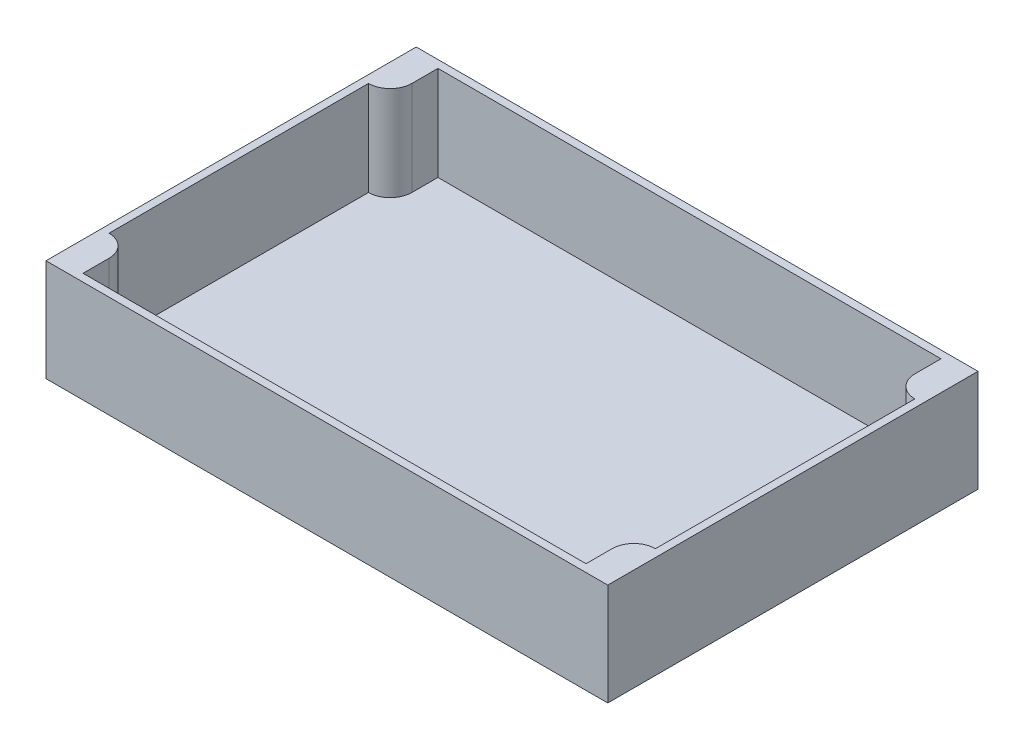
ISO-10303-21;
HEADER;
FILE_DESCRIPTION(('STEP AP214'),'2;1');
FILE_NAME('part.step','',(''),(''),'','','');
FILE_SCHEMA(('AUTOMOTIVE_DESIGN { 1 0 10303 214 1 1 1 1 }'));
ENDSEC;
DATA;
#1=APPLICATION_CONTEXT('core data for automotive mechanical design processes');
#2=APPLICATION_PROTOCOL_DEFINITION('international standard','automotive_design',2000,#1);
#3=PRODUCT_CONTEXT('',#1,'mechanical');
#4=PRODUCT('Part','Part','',(#3));
#5=PRODUCT_RELATED_PRODUCT_CATEGORY('part','',(#4));
#6=PRODUCT_DEFINITION_FORMATION('','',#4);
#7=PRODUCT_DEFINITION_CONTEXT('part definition',#1,'design');
#8=PRODUCT_DEFINITION('design','',#6,#7);
#9=PRODUCT_DEFINITION_SHAPE('','',#8);
#10=(LENGTH_UNIT() NAMED_UNIT(*) SI_UNIT(.MILLI.,.METRE.));
#11=(NAMED_UNIT(*) PLANE_ANGLE_UNIT() SI_UNIT($,.RADIAN.));
#12=(NAMED_UNIT(*) SI_UNIT($,.STERADIAN.) SOLID_ANGLE_UNIT());
#13=UNCERTAINTY_MEASURE_WITH_UNIT(LENGTH_MEASURE(1.E-05),#10,'distance_accuracy_value','');
#14=(GEOMETRIC_REPRESENTATION_CONTEXT(3) GLOBAL_UNCERTAINTY_ASSIGNED_CONTEXT((#13)) GLOBAL_UNIT_ASSIGNED_CONTEXT((#10,
#11,#12)) REPRESENTATION_CONTEXT('',''));
#15=CARTESIAN_POINT('',(0.,0.,0.));
#16=DIRECTION('',(0.,0.,1.));
#17=DIRECTION('',(1.,0.,0.));
#18=AXIS2_PLACEMENT_3D('',#15,#16,#17);
#19=CARTESIAN_POINT('',(0.,3.,0.));
#20=DIRECTION('',(1.,0.,0.));
#21=DIRECTION('',(0.,0.,-1.));
#22=AXIS2_PLACEMENT_3D('',#19,#20,#21);
#23=PLANE('',#22);
#24=DIRECTION('',(0.,0.,1.));
#25=VECTOR('',#24,1.);
#26=CARTESIAN_POINT('',(0.,0.,0.));
#27=LINE('',#26,#25);
#28=CARTESIAN_POINT('',(0.,0.,-145.));
#29=VERTEX_POINT('',#28);
#30=CARTESIAN_POINT('',(0.,0.,0.));
#31=VERTEX_POINT('',#30);
#32=EDGE_CURVE('E180',#29,#31,#27,.T.);
#33=ORIENTED_EDGE('',*,*,#32,.T.);
#34=DIRECTION('',(0.,-1.,0.));
#35=VECTOR('',#34,1.);
#36=CARTESIAN_POINT('',(0.,3.,0.));
#37=LINE('',#36,#35);
#38=CARTESIAN_POINT('',(0.,40.,0.));
#39=VERTEX_POINT('',#38);
#40=EDGE_CURVE('E12',#39,#31,#37,.T.);
#41=ORIENTED_EDGE('',*,*,#40,.F.);
#42=DIRECTION('',(0.,0.,-1.));
#43=VECTOR('',#42,1.);
#44=CARTESIAN_POINT('',(0.,40.,0.));
#45=LINE('',#44,#43);
#46=CARTESIAN_POINT('',(0.,40.,-145.));
#47=VERTEX_POINT('',#46);
#48=EDGE_CURVE('E168',#39,#47,#45,.T.);
#49=ORIENTED_EDGE('',*,*,#48,.T.);
#50=DIRECTION('',(0.,-1.,0.));
#51=VECTOR('',#50,1.);
#52=CARTESIAN_POINT('',(0.,3.,-145.));
#53=LINE('',#52,#51);
#54=EDGE_CURVE('E155',#47,#29,#53,.T.);
#55=ORIENTED_EDGE('',*,*,#54,.T.);
#56=EDGE_LOOP('',(#33,#41,#49,#55));
#57=FACE_BOUND('',#56,.T.);
#58=ADVANCED_FACE('F34',(#57),#23,.F.);
#59=CARTESIAN_POINT('',(0.,3.,0.));
#60=DIRECTION('',(0.,0.,-1.));
#61=DIRECTION('',(-1.,0.,0.));
#62=AXIS2_PLACEMENT_3D('',#59,#60,#61);
#63=PLANE('',#62);
#64=DIRECTION('',(1.,0.,0.));
#65=VECTOR('',#64,1.);
#66=CARTESIAN_POINT('',(0.,0.,0.));
#67=LINE('',#66,#65);
#68=CARTESIAN_POINT('',(220.,0.,0.));
#69=VERTEX_POINT('',#68);
#70=EDGE_CURVE('E201',#31,#69,#67,.T.);
#71=ORIENTED_EDGE('',*,*,#70,.T.);
#72=DIRECTION('',(0.,-1.,0.));
#73=VECTOR('',#72,1.);
#74=CARTESIAN_POINT('',(220.,3.,0.));
#75=LINE('',#74,#73);
#76=CARTESIAN_POINT('',(220.,40.,0.));
#77=VERTEX_POINT('',#76);
#78=EDGE_CURVE('E41',#77,#69,#75,.T.);
#79=ORIENTED_EDGE('',*,*,#78,.F.);
#80=DIRECTION('',(-1.,0.,0.));
#81=VECTOR('',#80,1.);
#82=CARTESIAN_POINT('',(220.,40.,0.));
#83=LINE('',#82,#81);
#84=EDGE_CURVE('E165',#77,#39,#83,.T.);
#85=ORIENTED_EDGE('',*,*,#84,.T.);
#86=ORIENTED_EDGE('',*,*,#40,.T.);
#87=EDGE_LOOP('',(#71,#79,#85,#86));
#88=FACE_BOUND('',#87,.T.);
#89=ADVANCED_FACE('F210',(#88),#63,.F.);
#90=CARTESIAN_POINT('',(220.,3.,0.));
#91=DIRECTION('',(-1.,0.,0.));
#92=DIRECTION('',(0.,0.,1.));
#93=AXIS2_PLACEMENT_3D('',#90,#91,#92);
#94=PLANE('',#93);
#95=DIRECTION('',(0.,0.,-1.));
#96=VECTOR('',#95,1.);
#97=CARTESIAN_POINT('',(220.,0.,0.));
#98=LINE('',#97,#96);
#99=CARTESIAN_POINT('',(220.,0.,-145.));
#100=VERTEX_POINT('',#99);
#101=EDGE_CURVE('E153',#69,#100,#98,.T.);
#102=ORIENTED_EDGE('',*,*,#101,.T.);
#103=DIRECTION('',(0.,-1.,0.));
#104=VECTOR('',#103,1.);
#105=CARTESIAN_POINT('',(220.,3.,-145.));
#106=LINE('',#105,#104);
#107=CARTESIAN_POINT('',(220.,40.,-145.));
#108=VERTEX_POINT('',#107);
#109=EDGE_CURVE('E147',#108,#100,#106,.T.);
#110=ORIENTED_EDGE('',*,*,#109,.F.);
#111=DIRECTION('',(0.,0.,1.));
#112=VECTOR('',#111,1.);
#113=CARTESIAN_POINT('',(220.,40.,0.));
#114=LINE('',#113,#112);
#115=EDGE_CURVE('E151',#108,#77,#114,.T.);
#116=ORIENTED_EDGE('',*,*,#115,.T.);
#117=ORIENTED_EDGE('',*,*,#78,.T.);
#118=EDGE_LOOP('',(#102,#110,#116,#117));
#119=FACE_BOUND('',#118,.T.);
#120=ADVANCED_FACE('F149',(#119),#94,.F.);
#121=CARTESIAN_POINT('',(0.,3.,-145.));
#122=DIRECTION('',(0.,0.,1.));
#123=DIRECTION('',(1.,0.,0.));
#124=AXIS2_PLACEMENT_3D('',#121,#122,#123);
#125=PLANE('',#124);
#126=DIRECTION('',(-1.,0.,0.));
#127=VECTOR('',#126,1.);
#128=CARTESIAN_POINT('',(0.,0.,-145.));
#129=LINE('',#128,#127);
#130=EDGE_CURVE('E56',#100,#29,#129,.T.);
#131=ORIENTED_EDGE('',*,*,#130,.T.);
#132=ORIENTED_EDGE('',*,*,#54,.F.);
#133=DIRECTION('',(1.,0.,0.));
#134=VECTOR('',#133,1.);
#135=CARTESIAN_POINT('',(220.,40.,-145.));
#136=LINE('',#135,#134);
#137=EDGE_CURVE('E162',#47,#108,#136,.T.);
#138=ORIENTED_EDGE('',*,*,#137,.T.);
#139=ORIENTED_EDGE('',*,*,#109,.T.);
#140=EDGE_LOOP('',(#131,#132,#138,#139));
#141=FACE_BOUND('',#140,.T.);
#142=ADVANCED_FACE('F167',(#141),#125,.F.);
#143=CARTESIAN_POINT('',(0.,0.,0.));
#144=DIRECTION('',(0.,-1.,0.));
#145=DIRECTION('',(0.,0.,-1.));
#146=AXIS2_PLACEMENT_3D('',#143,#144,#145);
#147=PLANE('',#146);
#148=ORIENTED_EDGE('',*,*,#32,.F.);
#149=ORIENTED_EDGE('',*,*,#130,.F.);
#150=ORIENTED_EDGE('',*,*,#101,.F.);
#151=ORIENTED_EDGE('',*,*,#70,.F.);
#152=EDGE_LOOP('',(#148,#149,#150,#151));
#153=FACE_BOUND('',#152,.T.);
#154=ADVANCED_FACE('F208',(#153),#147,.T.);
#155=CARTESIAN_POINT('',(3.00000000000001,343.486242525108,-13.2));
#156=DIRECTION('',(0.,-1.,0.));
#157=DIRECTION('',(0.,0.,-1.));
#158=AXIS2_PLACEMENT_3D('',#155,#156,#157);
#159=CYLINDRICAL_SURFACE('',#158,8.5);
#160=CARTESIAN_POINT('',(3.00000000000001,40.,-13.2));
#161=DIRECTION('',(0.,-1.,0.));
#162=DIRECTION('',(0.,0.,-1.));
#163=AXIS2_PLACEMENT_3D('',#160,#161,#162);
#164=CIRCLE('',#163,8.5);
#165=CARTESIAN_POINT('',(11.5,40.,-13.2));
#166=VERTEX_POINT('',#165);
#167=CARTESIAN_POINT('',(3.,40.,-21.7));
#168=VERTEX_POINT('',#167);
#169=EDGE_CURVE('E174',#166,#168,#164,.F.);
#170=ORIENTED_EDGE('',*,*,#169,.F.);
#171=DIRECTION('',(0.,-1.,0.));
#172=VECTOR('',#171,1.);
#173=CARTESIAN_POINT('',(11.5,343.486242525108,-13.2));
#174=LINE('',#173,#172);
#175=CARTESIAN_POINT('',(11.5,3.,-13.2));
#176=VERTEX_POINT('',#175);
#177=EDGE_CURVE('E170',#166,#176,#174,.T.);
#178=ORIENTED_EDGE('',*,*,#177,.T.);
#179=CARTESIAN_POINT('',(3.00000000000001,3.,-13.2));
#180=DIRECTION('',(0.,-1.,0.));
#181=DIRECTION('',(0.,0.,-1.));
#182=AXIS2_PLACEMENT_3D('',#179,#180,#181);
#183=CIRCLE('',#182,8.5);
#184=CARTESIAN_POINT('',(3.,3.,-21.7));
#185=VERTEX_POINT('',#184);
#186=EDGE_CURVE('E48',#185,#176,#183,.T.);
#187=ORIENTED_EDGE('',*,*,#186,.F.);
#188=DIRECTION('',(0.,-1.,0.));
#189=VECTOR('',#188,1.);
#190=CARTESIAN_POINT('',(3.,343.486242525108,-21.7));
#191=LINE('',#190,#189);
#192=EDGE_CURVE('E177',#168,#185,#191,.T.);
#193=ORIENTED_EDGE('',*,*,#192,.F.);
#194=EDGE_LOOP('',(#170,#178,#187,#193));
#195=FACE_BOUND('',#194,.T.);
#196=ADVANCED_FACE('F277',(#195),#159,.T.);
#197=CARTESIAN_POINT('',(11.5,343.486242525108,-13.2));
#198=DIRECTION('',(1.,0.,0.));
#199=DIRECTION('',(0.,0.,-1.));
#200=AXIS2_PLACEMENT_3D('',#197,#198,#199);
#201=PLANE('',#200);
#202=DIRECTION('',(0.,0.,-1.));
#203=VECTOR('',#202,1.);
#204=CARTESIAN_POINT('',(11.5,40.,-13.2));
#205=LINE('',#204,#203);
#206=CARTESIAN_POINT('',(11.5,40.,-3.00000000000001));
#207=VERTEX_POINT('',#206);
#208=EDGE_CURVE('E178',#207,#166,#205,.T.);
#209=ORIENTED_EDGE('',*,*,#208,.F.);
#210=DIRECTION('',(0.,-1.,0.));
#211=VECTOR('',#210,1.);
#212=CARTESIAN_POINT('',(11.5,343.486242525108,-3.00000000000001));
#213=LINE('',#212,#211);
#214=CARTESIAN_POINT('',(11.5,3.,-3.00000000000001));
#215=VERTEX_POINT('',#214);
#216=EDGE_CURVE('E235',#207,#215,#213,.T.);
#217=ORIENTED_EDGE('',*,*,#216,.T.);
#218=DIRECTION('',(0.,0.,1.));
#219=VECTOR('',#218,1.);
#220=CARTESIAN_POINT('',(11.5,3.,-13.2));
#221=LINE('',#220,#219);
#222=EDGE_CURVE('E240',#176,#215,#221,.T.);
#223=ORIENTED_EDGE('',*,*,#222,.F.);
#224=ORIENTED_EDGE('',*,*,#177,.F.);
#225=EDGE_LOOP('',(#209,#217,#223,#224));
#226=FACE_BOUND('',#225,.T.);
#227=ADVANCED_FACE('F283',(#226),#201,.T.);
#228=CARTESIAN_POINT('',(11.5,343.486242525108,-3.00000000000001));
#229=DIRECTION('',(0.,0.,-1.));
#230=DIRECTION('',(-1.,0.,0.));
#231=AXIS2_PLACEMENT_3D('',#228,#229,#230);
#232=PLANE('',#231);
#233=DIRECTION('',(-1.,0.,0.));
#234=VECTOR('',#233,1.);
#235=CARTESIAN_POINT('',(11.5,40.,-3.00000000000001));
#236=LINE('',#235,#234);
#237=CARTESIAN_POINT('',(208.5,40.,-3.00000000000003));
#238=VERTEX_POINT('',#237);
#239=EDGE_CURVE('E181',#238,#207,#236,.T.);
#240=ORIENTED_EDGE('',*,*,#239,.F.);
#241=DIRECTION('',(0.,-1.,0.));
#242=VECTOR('',#241,1.);
#243=CARTESIAN_POINT('',(208.5,343.486242525108,-3.00000000000003));
#244=LINE('',#243,#242);
#245=CARTESIAN_POINT('',(208.5,3.,-3.00000000000003));
#246=VERTEX_POINT('',#245);
#247=EDGE_CURVE('E233',#238,#246,#244,.T.);
#248=ORIENTED_EDGE('',*,*,#247,.T.);
#249=DIRECTION('',(1.,0.,0.));
#250=VECTOR('',#249,1.);
#251=CARTESIAN_POINT('',(11.5,3.,-3.00000000000001));
#252=LINE('',#251,#250);
#253=EDGE_CURVE('E244',#215,#246,#252,.T.);
#254=ORIENTED_EDGE('',*,*,#253,.F.);
#255=ORIENTED_EDGE('',*,*,#216,.F.);
#256=EDGE_LOOP('',(#240,#248,#254,#255));
#257=FACE_BOUND('',#256,.T.);
#258=ADVANCED_FACE('F289',(#257),#232,.T.);
#259=CARTESIAN_POINT('',(208.5,343.486242525108,-13.2000000000001));
#260=DIRECTION('',(-1.,0.,0.));
#261=DIRECTION('',(0.,0.,1.));
#262=AXIS2_PLACEMENT_3D('',#259,#260,#261);
#263=PLANE('',#262);
#264=DIRECTION('',(0.,0.,1.));
#265=VECTOR('',#264,1.);
#266=CARTESIAN_POINT('',(208.5,40.,-13.2000000000001));
#267=LINE('',#266,#265);
#268=CARTESIAN_POINT('',(208.5,40.,-13.2000000000001));
#269=VERTEX_POINT('',#268);
#270=EDGE_CURVE('E183',#269,#238,#267,.T.);
#271=ORIENTED_EDGE('',*,*,#270,.F.);
#272=DIRECTION('',(0.,-1.,0.));
#273=VECTOR('',#272,1.);
#274=CARTESIAN_POINT('',(208.5,343.486242525108,-13.2000000000001));
#275=LINE('',#274,#273);
#276=CARTESIAN_POINT('',(208.5,3.,-13.2000000000001));
#277=VERTEX_POINT('',#276);
#278=EDGE_CURVE('E231',#269,#277,#275,.T.);
#279=ORIENTED_EDGE('',*,*,#278,.T.);
#280=DIRECTION('',(0.,0.,-1.));
#281=VECTOR('',#280,1.);
#282=CARTESIAN_POINT('',(208.5,3.,-13.2000000000001));
#283=LINE('',#282,#281);
#284=EDGE_CURVE('E247',#246,#277,#283,.T.);
#285=ORIENTED_EDGE('',*,*,#284,.F.);
#286=ORIENTED_EDGE('',*,*,#247,.F.);
#287=EDGE_LOOP('',(#271,#279,#285,#286));
#288=FACE_BOUND('',#287,.T.);
#289=ADVANCED_FACE('F293',(#288),#263,.T.);
#290=CARTESIAN_POINT('',(217.,343.486242525108,-13.2000000000001));
#291=DIRECTION('',(0.,-1.,0.));
#292=DIRECTION('',(0.,0.,-1.));
#293=AXIS2_PLACEMENT_3D('',#290,#291,#292);
#294=CYLINDRICAL_SURFACE('',#293,8.49999999999999);
#295=CARTESIAN_POINT('',(217.,40.,-13.2000000000001));
#296=DIRECTION('',(0.,-1.,0.));
#297=DIRECTION('',(0.,0.,-1.));
#298=AXIS2_PLACEMENT_3D('',#295,#296,#297);
#299=CIRCLE('',#298,8.49999999999999);
#300=CARTESIAN_POINT('',(217.,40.,-21.7));
#301=VERTEX_POINT('',#300);
#302=EDGE_CURVE('E185',#301,#269,#299,.F.);
#303=ORIENTED_EDGE('',*,*,#302,.F.);
#304=DIRECTION('',(0.,-1.,0.));
#305=VECTOR('',#304,1.);
#306=CARTESIAN_POINT('',(217.,343.486242525108,-21.7));
#307=LINE('',#306,#305);
#308=CARTESIAN_POINT('',(217.,3.,-21.7));
#309=VERTEX_POINT('',#308);
#310=EDGE_CURVE('E229',#301,#309,#307,.T.);
#311=ORIENTED_EDGE('',*,*,#310,.T.);
#312=CARTESIAN_POINT('',(217.,3.,-13.2000000000001));
#313=DIRECTION('',(0.,-1.,0.));
#314=DIRECTION('',(0.,0.,1.));
#315=AXIS2_PLACEMENT_3D('',#312,#313,#314);
#316=CIRCLE('',#315,8.49999999999999);
#317=EDGE_CURVE('E250',#277,#309,#316,.T.);
#318=ORIENTED_EDGE('',*,*,#317,.F.);
#319=ORIENTED_EDGE('',*,*,#278,.F.);
#320=EDGE_LOOP('',(#303,#311,#318,#319));
#321=FACE_BOUND('',#320,.T.);
#322=ADVANCED_FACE('F298',(#321),#294,.T.);
#323=CARTESIAN_POINT('',(217.,343.486242525108,-123.3));
#324=DIRECTION('',(-1.,0.,0.));
#325=DIRECTION('',(0.,0.,1.));
#326=AXIS2_PLACEMENT_3D('',#323,#324,#325);
#327=PLANE('',#326);
#328=DIRECTION('',(0.,0.,1.));
#329=VECTOR('',#328,1.);
#330=CARTESIAN_POINT('',(217.,40.,-123.3));
#331=LINE('',#330,#329);
#332=CARTESIAN_POINT('',(217.,40.,-123.3));
#333=VERTEX_POINT('',#332);
#334=EDGE_CURVE('E187',#333,#301,#331,.T.);
#335=ORIENTED_EDGE('',*,*,#334,.F.);
#336=DIRECTION('',(0.,-1.,0.));
#337=VECTOR('',#336,1.);
#338=CARTESIAN_POINT('',(217.,343.486242525108,-123.3));
#339=LINE('',#338,#337);
#340=CARTESIAN_POINT('',(217.,3.,-123.3));
#341=VERTEX_POINT('',#340);
#342=EDGE_CURVE('E227',#333,#341,#339,.T.);
#343=ORIENTED_EDGE('',*,*,#342,.T.);
#344=DIRECTION('',(0.,0.,-1.));
#345=VECTOR('',#344,1.);
#346=CARTESIAN_POINT('',(217.,3.,-123.3));
#347=LINE('',#346,#345);
#348=EDGE_CURVE('E253',#309,#341,#347,.T.);
#349=ORIENTED_EDGE('',*,*,#348,.F.);
#350=ORIENTED_EDGE('',*,*,#310,.F.);
#351=EDGE_LOOP('',(#335,#343,#349,#350));
#352=FACE_BOUND('',#351,.T.);
#353=ADVANCED_FACE('F304',(#352),#327,.T.);
#354=CARTESIAN_POINT('',(217.,343.486242525108,-131.8));
#355=DIRECTION('',(0.,-1.,0.));
#356=DIRECTION('',(0.,0.,-1.));
#357=AXIS2_PLACEMENT_3D('',#354,#355,#356);
#358=CYLINDRICAL_SURFACE('',#357,8.49999999999999);
#359=CARTESIAN_POINT('',(217.,40.,-131.8));
#360=DIRECTION('',(0.,-1.,0.));
#361=DIRECTION('',(0.,0.,-1.));
#362=AXIS2_PLACEMENT_3D('',#359,#360,#361);
#363=CIRCLE('',#362,8.49999999999999);
#364=CARTESIAN_POINT('',(208.5,40.,-131.8));
#365=VERTEX_POINT('',#364);
#366=EDGE_CURVE('E189',#365,#333,#363,.F.);
#367=ORIENTED_EDGE('',*,*,#366,.F.);
#368=DIRECTION('',(0.,-1.,0.));
#369=VECTOR('',#368,1.);
#370=CARTESIAN_POINT('',(208.5,343.486242525108,-131.8));
#371=LINE('',#370,#369);
#372=CARTESIAN_POINT('',(208.5,3.,-131.8));
#373=VERTEX_POINT('',#372);
#374=EDGE_CURVE('E225',#365,#373,#371,.T.);
#375=ORIENTED_EDGE('',*,*,#374,.T.);
#376=CARTESIAN_POINT('',(217.,3.,-131.8));
#377=DIRECTION('',(0.,-1.,0.));
#378=DIRECTION('',(0.,0.,-1.));
#379=AXIS2_PLACEMENT_3D('',#376,#377,#378);
#380=CIRCLE('',#379,8.49999999999999);
#381=EDGE_CURVE('E256',#341,#373,#380,.T.);
#382=ORIENTED_EDGE('',*,*,#381,.F.);
#383=ORIENTED_EDGE('',*,*,#342,.F.);
#384=EDGE_LOOP('',(#367,#375,#382,#383));
#385=FACE_BOUND('',#384,.T.);
#386=ADVANCED_FACE('F308',(#385),#358,.T.);
#387=CARTESIAN_POINT('',(208.5,343.486242525108,-131.8));
#388=DIRECTION('',(-1.,0.,0.));
#389=DIRECTION('',(0.,0.,1.));
#390=AXIS2_PLACEMENT_3D('',#387,#388,#389);
#391=PLANE('',#390);
#392=DIRECTION('',(0.,0.,1.));
#393=VECTOR('',#392,1.);
#394=CARTESIAN_POINT('',(208.5,40.,-131.8));
#395=LINE('',#394,#393);
#396=CARTESIAN_POINT('',(208.5,40.,-142.));
#397=VERTEX_POINT('',#396);
#398=EDGE_CURVE('E191',#397,#365,#395,.T.);
#399=ORIENTED_EDGE('',*,*,#398,.F.);
#400=DIRECTION('',(0.,-1.,0.));
#401=VECTOR('',#400,1.);
#402=CARTESIAN_POINT('',(208.5,343.486242525108,-142.));
#403=LINE('',#402,#401);
#404=CARTESIAN_POINT('',(208.5,3.,-142.));
#405=VERTEX_POINT('',#404);
#406=EDGE_CURVE('E223',#397,#405,#403,.T.);
#407=ORIENTED_EDGE('',*,*,#406,.T.);
#408=DIRECTION('',(0.,0.,-1.));
#409=VECTOR('',#408,1.);
#410=CARTESIAN_POINT('',(208.5,3.,-131.8));
#411=LINE('',#410,#409);
#412=EDGE_CURVE('E259',#373,#405,#411,.T.);
#413=ORIENTED_EDGE('',*,*,#412,.F.);
#414=ORIENTED_EDGE('',*,*,#374,.F.);
#415=EDGE_LOOP('',(#399,#407,#413,#414));
#416=FACE_BOUND('',#415,.T.);
#417=ADVANCED_FACE('F313',(#416),#391,.T.);
#418=CARTESIAN_POINT('',(11.5,343.486242525108,-142.));
#419=DIRECTION('',(0.,0.,1.));
#420=DIRECTION('',(1.,0.,0.));
#421=AXIS2_PLACEMENT_3D('',#418,#419,#420);
#422=PLANE('',#421);
#423=DIRECTION('',(1.,0.,0.));
#424=VECTOR('',#423,1.);
#425=CARTESIAN_POINT('',(11.5,40.,-142.));
#426=LINE('',#425,#424);
#427=CARTESIAN_POINT('',(11.5,40.,-142.));
#428=VERTEX_POINT('',#427);
#429=EDGE_CURVE('E193',#428,#397,#426,.T.);
#430=ORIENTED_EDGE('',*,*,#429,.F.);
#431=DIRECTION('',(0.,-1.,0.));
#432=VECTOR('',#431,1.);
#433=CARTESIAN_POINT('',(11.5,343.486242525108,-142.));
#434=LINE('',#433,#432);
#435=CARTESIAN_POINT('',(11.5,3.,-142.));
#436=VERTEX_POINT('',#435);
#437=EDGE_CURVE('E221',#428,#436,#434,.T.);
#438=ORIENTED_EDGE('',*,*,#437,.T.);
#439=DIRECTION('',(-1.,0.,0.));
#440=VECTOR('',#439,1.);
#441=CARTESIAN_POINT('',(11.5,3.,-142.));
#442=LINE('',#441,#440);
#443=EDGE_CURVE('E262',#405,#436,#442,.T.);
#444=ORIENTED_EDGE('',*,*,#443,.F.);
#445=ORIENTED_EDGE('',*,*,#406,.F.);
#446=EDGE_LOOP('',(#430,#438,#444,#445));
#447=FACE_BOUND('',#446,.T.);
#448=ADVANCED_FACE('F319',(#447),#422,.T.);
#449=CARTESIAN_POINT('',(11.5,343.486242525108,-131.8));
#450=DIRECTION('',(1.,0.,0.));
#451=DIRECTION('',(0.,0.,-1.));
#452=AXIS2_PLACEMENT_3D('',#449,#450,#451);
#453=PLANE('',#452);
#454=DIRECTION('',(0.,0.,-1.));
#455=VECTOR('',#454,1.);
#456=CARTESIAN_POINT('',(11.5,40.,-131.8));
#457=LINE('',#456,#455);
#458=CARTESIAN_POINT('',(11.5,40.,-131.8));
#459=VERTEX_POINT('',#458);
#460=EDGE_CURVE('E195',#459,#428,#457,.T.);
#461=ORIENTED_EDGE('',*,*,#460,.F.);
#462=DIRECTION('',(0.,-1.,0.));
#463=VECTOR('',#462,1.);
#464=CARTESIAN_POINT('',(11.5,343.486242525108,-131.8));
#465=LINE('',#464,#463);
#466=CARTESIAN_POINT('',(11.5,3.,-131.8));
#467=VERTEX_POINT('',#466);
#468=EDGE_CURVE('E219',#459,#467,#465,.T.);
#469=ORIENTED_EDGE('',*,*,#468,.T.);
#470=DIRECTION('',(0.,0.,1.));
#471=VECTOR('',#470,1.);
#472=CARTESIAN_POINT('',(11.5,3.,-131.8));
#473=LINE('',#472,#471);
#474=EDGE_CURVE('E213',#436,#467,#473,.T.);
#475=ORIENTED_EDGE('',*,*,#474,.F.);
#476=ORIENTED_EDGE('',*,*,#437,.F.);
#477=EDGE_LOOP('',(#461,#469,#475,#476));
#478=FACE_BOUND('',#477,.T.);
#479=ADVANCED_FACE('F323',(#478),#453,.T.);
#480=CARTESIAN_POINT('',(3.00000000000002,343.486242525108,-131.8));
#481=DIRECTION('',(0.,-1.,0.));
#482=DIRECTION('',(0.,0.,-1.));
#483=AXIS2_PLACEMENT_3D('',#480,#481,#482);
#484=CYLINDRICAL_SURFACE('',#483,8.49999999999998);
#485=CARTESIAN_POINT('',(3.00000000000002,40.,-131.8));
#486=DIRECTION('',(0.,-1.,0.));
#487=DIRECTION('',(0.,0.,-1.));
#488=AXIS2_PLACEMENT_3D('',#485,#486,#487);
#489=CIRCLE('',#488,8.49999999999998);
#490=CARTESIAN_POINT('',(3.00000000000001,40.,-123.3));
#491=VERTEX_POINT('',#490);
#492=EDGE_CURVE('E197',#491,#459,#489,.F.);
#493=ORIENTED_EDGE('',*,*,#492,.F.);
#494=DIRECTION('',(0.,-1.,0.));
#495=VECTOR('',#494,1.);
#496=CARTESIAN_POINT('',(3.00000000000001,343.486242525108,-123.3));
#497=LINE('',#496,#495);
#498=CARTESIAN_POINT('',(3.00000000000001,3.,-123.3));
#499=VERTEX_POINT('',#498);
#500=EDGE_CURVE('E217',#491,#499,#497,.T.);
#501=ORIENTED_EDGE('',*,*,#500,.T.);
#502=CARTESIAN_POINT('',(3.00000000000002,3.,-131.8));
#503=DIRECTION('',(0.,-1.,0.));
#504=DIRECTION('',(0.,0.,1.));
#505=AXIS2_PLACEMENT_3D('',#502,#503,#504);
#506=CIRCLE('',#505,8.49999999999998);
#507=EDGE_CURVE('E211',#467,#499,#506,.T.);
#508=ORIENTED_EDGE('',*,*,#507,.F.);
#509=ORIENTED_EDGE('',*,*,#468,.F.);
#510=EDGE_LOOP('',(#493,#501,#508,#509));
#511=FACE_BOUND('',#510,.T.);
#512=ADVANCED_FACE('F327',(#511),#484,.T.);
#513=CARTESIAN_POINT('',(3.00000000000001,343.486242525108,-123.3));
#514=DIRECTION('',(1.,0.,0.));
#515=DIRECTION('',(0.,0.,-1.));
#516=AXIS2_PLACEMENT_3D('',#513,#514,#515);
#517=PLANE('',#516);
#518=DIRECTION('',(0.,0.,-1.));
#519=VECTOR('',#518,1.);
#520=CARTESIAN_POINT('',(3.00000000000001,40.,-123.3));
#521=LINE('',#520,#519);
#522=EDGE_CURVE('E176',#168,#491,#521,.T.);
#523=ORIENTED_EDGE('',*,*,#522,.F.);
#524=ORIENTED_EDGE('',*,*,#192,.T.);
#525=DIRECTION('',(0.,0.,1.));
#526=VECTOR('',#525,1.);
#527=CARTESIAN_POINT('',(3.00000000000001,3.,-123.3));
#528=LINE('',#527,#526);
#529=EDGE_CURVE('E241',#499,#185,#528,.T.);
#530=ORIENTED_EDGE('',*,*,#529,.F.);
#531=ORIENTED_EDGE('',*,*,#500,.F.);
#532=EDGE_LOOP('',(#523,#524,#530,#531));
#533=FACE_BOUND('',#532,.T.);
#534=ADVANCED_FACE('F275',(#533),#517,.T.);
#535=CARTESIAN_POINT('',(0.,40.,0.));
#536=DIRECTION('',(0.,-1.,0.));
#537=DIRECTION('',(0.,0.,-1.));
#538=AXIS2_PLACEMENT_3D('',#535,#536,#537);
#539=PLANE('',#538);
#540=ORIENTED_EDGE('',*,*,#169,.T.);
#541=ORIENTED_EDGE('',*,*,#522,.T.);
#542=ORIENTED_EDGE('',*,*,#492,.T.);
#543=ORIENTED_EDGE('',*,*,#460,.T.);
#544=ORIENTED_EDGE('',*,*,#429,.T.);
#545=ORIENTED_EDGE('',*,*,#398,.T.);
#546=ORIENTED_EDGE('',*,*,#366,.T.);
#547=ORIENTED_EDGE('',*,*,#334,.T.);
#548=ORIENTED_EDGE('',*,*,#302,.T.);
#549=ORIENTED_EDGE('',*,*,#270,.T.);
#550=ORIENTED_EDGE('',*,*,#239,.T.);
#551=ORIENTED_EDGE('',*,*,#208,.T.);
#552=EDGE_LOOP('',(#540,#541,#542,#543,#544,#545,#546,#547,#548,#549,#550,#551));
#553=FACE_BOUND('',#552,.T.);
#554=ORIENTED_EDGE('',*,*,#115,.F.);
#555=ORIENTED_EDGE('',*,*,#137,.F.);
#556=ORIENTED_EDGE('',*,*,#48,.F.);
#557=ORIENTED_EDGE('',*,*,#84,.F.);
#558=EDGE_LOOP('',(#554,#555,#556,#557));
#559=FACE_BOUND('',#558,.T.);
#560=ADVANCED_FACE('F160',(#553,#559),#539,.F.);
#561=CARTESIAN_POINT('',(0.,3.,0.));
#562=DIRECTION('',(0.,-1.,0.));
#563=DIRECTION('',(0.,0.,-1.));
#564=AXIS2_PLACEMENT_3D('',#561,#562,#563);
#565=PLANE('',#564);
#566=ORIENTED_EDGE('',*,*,#529,.T.);
#567=ORIENTED_EDGE('',*,*,#186,.T.);
#568=ORIENTED_EDGE('',*,*,#222,.T.);
#569=ORIENTED_EDGE('',*,*,#253,.T.);
#570=ORIENTED_EDGE('',*,*,#284,.T.);
#571=ORIENTED_EDGE('',*,*,#317,.T.);
#572=ORIENTED_EDGE('',*,*,#348,.T.);
#573=ORIENTED_EDGE('',*,*,#381,.T.);
#574=ORIENTED_EDGE('',*,*,#412,.T.);
#575=ORIENTED_EDGE('',*,*,#443,.T.);
#576=ORIENTED_EDGE('',*,*,#474,.T.);
#577=ORIENTED_EDGE('',*,*,#507,.T.);
#578=EDGE_LOOP('',(#566,#567,#568,#569,#570,#571,#572,#573,#574,#575,#576,#577));
#579=FACE_BOUND('',#578,.T.);
#580=ADVANCED_FACE('F270',(#579),#565,.F.);
#581=CLOSED_SHELL('',(#58,#89,#120,#142,#154,#196,#227,#258,#289,#322,#353,#386,#417,#448,#479,
#512,#534,#560,#580));
#582=MANIFOLD_SOLID_BREP('B2',#581);
#583=ADVANCED_BREP_SHAPE_REPRESENTATION('',(#18,#582),#14);
#584=SHAPE_DEFINITION_REPRESENTATION(#9,#583);
ENDSEC;
END-ISO-10303-21;
